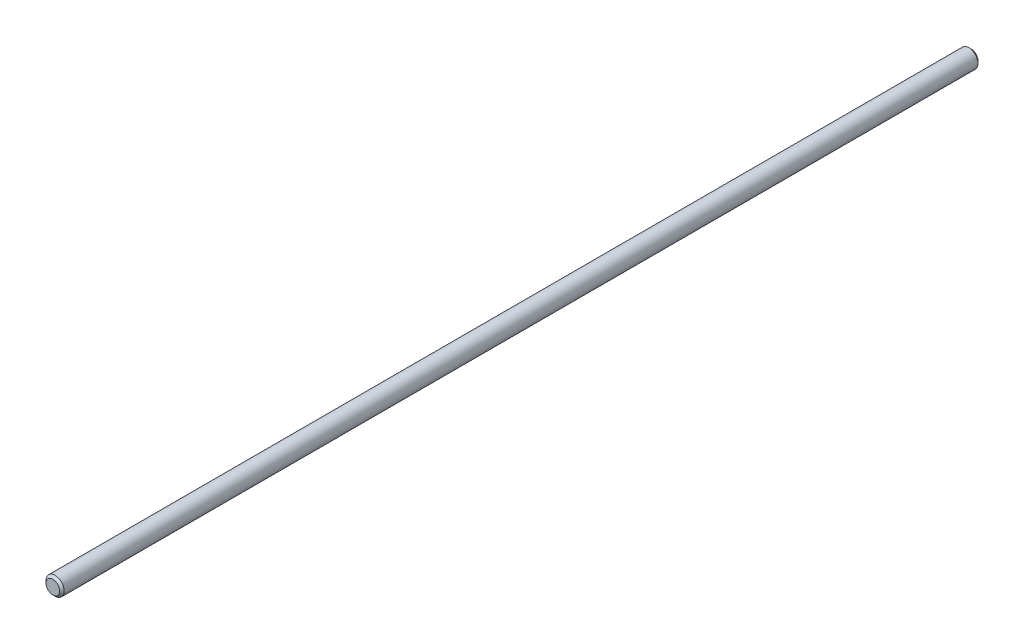
ISO-10303-21;
HEADER;
FILE_DESCRIPTION(('STEP AP214'),'2;1');
FILE_NAME('part.step','',(''),(''),'','','');
FILE_SCHEMA(('AUTOMOTIVE_DESIGN { 1 0 10303 214 1 1 1 1 }'));
ENDSEC;
DATA;
#1=APPLICATION_CONTEXT('core data for automotive mechanical design processes');
#2=APPLICATION_PROTOCOL_DEFINITION('international standard','automotive_design',2000,#1);
#3=PRODUCT_CONTEXT('',#1,'mechanical');
#4=PRODUCT('Part','Part','',(#3));
#5=PRODUCT_RELATED_PRODUCT_CATEGORY('part','',(#4));
#6=PRODUCT_DEFINITION_FORMATION('','',#4);
#7=PRODUCT_DEFINITION_CONTEXT('part definition',#1,'design');
#8=PRODUCT_DEFINITION('design','',#6,#7);
#9=PRODUCT_DEFINITION_SHAPE('','',#8);
#10=(LENGTH_UNIT() NAMED_UNIT(*) SI_UNIT(.MILLI.,.METRE.));
#11=(NAMED_UNIT(*) PLANE_ANGLE_UNIT() SI_UNIT($,.RADIAN.));
#12=(NAMED_UNIT(*) SI_UNIT($,.STERADIAN.) SOLID_ANGLE_UNIT());
#13=UNCERTAINTY_MEASURE_WITH_UNIT(LENGTH_MEASURE(1.E-05),#10,'distance_accuracy_value','');
#14=(GEOMETRIC_REPRESENTATION_CONTEXT(3) GLOBAL_UNCERTAINTY_ASSIGNED_CONTEXT((#13)) GLOBAL_UNIT_ASSIGNED_CONTEXT((#10,
#11,#12)) REPRESENTATION_CONTEXT('',''));
#15=CARTESIAN_POINT('',(0.,0.,0.));
#16=DIRECTION('',(0.,0.,1.));
#17=DIRECTION('',(1.,0.,0.));
#18=AXIS2_PLACEMENT_3D('',#15,#16,#17);
#19=CARTESIAN_POINT('',(0.,0.,405.));
#20=DIRECTION('',(0.,0.,-1.));
#21=DIRECTION('',(-1.,0.,0.));
#22=AXIS2_PLACEMENT_3D('',#19,#20,#21);
#23=CYLINDRICAL_SURFACE('',#22,4.);
#24=CARTESIAN_POINT('',(0.,0.,404.));
#25=DIRECTION('',(0.,0.,1.));
#26=DIRECTION('',(1.,0.,0.));
#27=AXIS2_PLACEMENT_3D('',#24,#25,#26);
#28=CIRCLE('',#27,4.);
#29=CARTESIAN_POINT('',(4.,0.,404.));
#30=VERTEX_POINT('',#29);
#31=EDGE_CURVE('E10',#30,#30,#28,.F.);
#32=ORIENTED_EDGE('',*,*,#31,.T.);
#33=EDGE_LOOP('',(#32));
#34=FACE_BOUND('',#33,.T.);
#35=CARTESIAN_POINT('',(0.,0.,0.999999999999945));
#36=DIRECTION('',(0.,0.,1.));
#37=DIRECTION('',(1.,0.,0.));
#38=AXIS2_PLACEMENT_3D('',#35,#36,#37);
#39=CIRCLE('',#38,4.);
#40=CARTESIAN_POINT('',(4.,0.,0.999999999999945));
#41=VERTEX_POINT('',#40);
#42=EDGE_CURVE('E46',#41,#41,#39,.T.);
#43=ORIENTED_EDGE('',*,*,#42,.T.);
#44=EDGE_LOOP('',(#43));
#45=FACE_BOUND('',#44,.T.);
#46=ADVANCED_FACE('F31',(#34,#45),#23,.T.);
#47=CARTESIAN_POINT('',(0.,0.,405.));
#48=DIRECTION('',(0.,0.,1.));
#49=DIRECTION('',(1.,0.,0.));
#50=AXIS2_PLACEMENT_3D('',#47,#48,#49);
#51=PLANE('',#50);
#52=CARTESIAN_POINT('',(0.,0.,405.));
#53=DIRECTION('',(0.,0.,1.));
#54=DIRECTION('',(1.,0.,0.));
#55=AXIS2_PLACEMENT_3D('',#52,#53,#54);
#56=CIRCLE('',#55,3.00000000000006);
#57=CARTESIAN_POINT('',(3.00000000000006,0.,405.));
#58=VERTEX_POINT('',#57);
#59=EDGE_CURVE('E38',#58,#58,#56,.T.);
#60=ORIENTED_EDGE('',*,*,#59,.T.);
#61=EDGE_LOOP('',(#60));
#62=FACE_BOUND('',#61,.T.);
#63=ADVANCED_FACE('F62',(#62),#51,.T.);
#64=CARTESIAN_POINT('',(0.,0.,0.));
#65=DIRECTION('',(0.,0.,1.));
#66=DIRECTION('',(1.,0.,0.));
#67=AXIS2_PLACEMENT_3D('',#64,#65,#66);
#68=PLANE('',#67);
#69=CARTESIAN_POINT('',(0.,0.,0.));
#70=DIRECTION('',(0.,0.,1.));
#71=DIRECTION('',(1.,0.,0.));
#72=AXIS2_PLACEMENT_3D('',#69,#70,#71);
#73=CIRCLE('',#72,3.);
#74=CARTESIAN_POINT('',(3.,0.,0.));
#75=VERTEX_POINT('',#74);
#76=EDGE_CURVE('E42',#75,#75,#73,.F.);
#77=ORIENTED_EDGE('',*,*,#76,.T.);
#78=EDGE_LOOP('',(#77));
#79=FACE_BOUND('',#78,.T.);
#80=ADVANCED_FACE('F55',(#79),#68,.F.);
#81=CARTESIAN_POINT('',(0.,0.,0.999999999999945));
#82=DIRECTION('',(0.,0.,1.));
#83=DIRECTION('',(1.,0.,0.));
#84=AXIS2_PLACEMENT_3D('',#81,#82,#83);
#85=CONICAL_SURFACE('',#84,4.,0.785398163397474);
#86=ORIENTED_EDGE('',*,*,#76,.F.);
#87=EDGE_LOOP('',(#86));
#88=FACE_BOUND('',#87,.T.);
#89=ORIENTED_EDGE('',*,*,#42,.F.);
#90=EDGE_LOOP('',(#89));
#91=FACE_BOUND('',#90,.T.);
#92=ADVANCED_FACE('F53',(#88,#91),#85,.T.);
#93=CARTESIAN_POINT('',(0.,0.,405.));
#94=DIRECTION('',(0.,0.,-1.));
#95=DIRECTION('',(-1.,0.,0.));
#96=AXIS2_PLACEMENT_3D('',#93,#94,#95);
#97=CONICAL_SURFACE('',#96,3.00000000000006,0.785398163397447);
#98=ORIENTED_EDGE('',*,*,#31,.F.);
#99=EDGE_LOOP('',(#98));
#100=FACE_BOUND('',#99,.T.);
#101=ORIENTED_EDGE('',*,*,#59,.F.);
#102=EDGE_LOOP('',(#101));
#103=FACE_BOUND('',#102,.T.);
#104=ADVANCED_FACE('F33',(#100,#103),#97,.T.);
#105=CLOSED_SHELL('',(#46,#63,#80,#92,#104));
#106=MANIFOLD_SOLID_BREP('B2',#105);
#107=ADVANCED_BREP_SHAPE_REPRESENTATION('',(#18,#106),#14);
#108=SHAPE_DEFINITION_REPRESENTATION(#9,#107);
ENDSEC;
END-ISO-10303-21;
